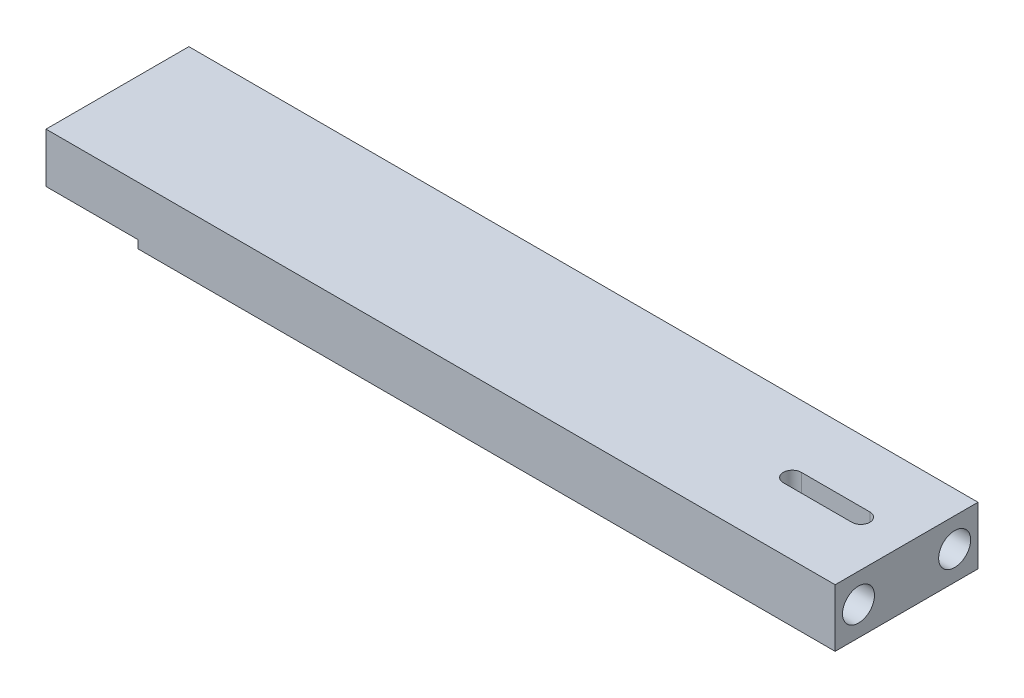
ISO-10303-21;
HEADER;
FILE_DESCRIPTION(('STEP AP214'),'2;1');
FILE_NAME('part.step','',(''),(''),'','','');
FILE_SCHEMA(('AUTOMOTIVE_DESIGN { 1 0 10303 214 1 1 1 1 }'));
ENDSEC;
DATA;
#1=APPLICATION_CONTEXT('core data for automotive mechanical design processes');
#2=APPLICATION_PROTOCOL_DEFINITION('international standard','automotive_design',2000,#1);
#3=PRODUCT_CONTEXT('',#1,'mechanical');
#4=PRODUCT('Part','Part','',(#3));
#5=PRODUCT_RELATED_PRODUCT_CATEGORY('part','',(#4));
#6=PRODUCT_DEFINITION_FORMATION('','',#4);
#7=PRODUCT_DEFINITION_CONTEXT('part definition',#1,'design');
#8=PRODUCT_DEFINITION('design','',#6,#7);
#9=PRODUCT_DEFINITION_SHAPE('','',#8);
#10=(LENGTH_UNIT() NAMED_UNIT(*) SI_UNIT(.MILLI.,.METRE.));
#11=(NAMED_UNIT(*) PLANE_ANGLE_UNIT() SI_UNIT($,.RADIAN.));
#12=(NAMED_UNIT(*) SI_UNIT($,.STERADIAN.) SOLID_ANGLE_UNIT());
#13=UNCERTAINTY_MEASURE_WITH_UNIT(LENGTH_MEASURE(1.E-05),#10,'distance_accuracy_value','');
#14=(GEOMETRIC_REPRESENTATION_CONTEXT(3) GLOBAL_UNCERTAINTY_ASSIGNED_CONTEXT((#13)) GLOBAL_UNIT_ASSIGNED_CONTEXT((#10,
#11,#12)) REPRESENTATION_CONTEXT('',''));
#15=CARTESIAN_POINT('',(0.,0.,0.));
#16=DIRECTION('',(0.,0.,1.));
#17=DIRECTION('',(1.,0.,0.));
#18=AXIS2_PLACEMENT_3D('',#15,#16,#17);
#19=CARTESIAN_POINT('',(49.75,0.,0.));
#20=DIRECTION('',(0.,1.,0.));
#21=DIRECTION('',(0.,0.,1.));
#22=AXIS2_PLACEMENT_3D('',#19,#20,#21);
#23=CYLINDRICAL_SURFACE('',#22,1.575);
#24=CARTESIAN_POINT('',(49.75,5.5,0.));
#25=DIRECTION('',(0.,-1.,0.));
#26=DIRECTION('',(0.,0.,-1.));
#27=AXIS2_PLACEMENT_3D('',#24,#25,#26);
#28=CIRCLE('',#27,1.575);
#29=CARTESIAN_POINT('',(49.75,5.5,-1.575));
#30=VERTEX_POINT('',#29);
#31=CARTESIAN_POINT('',(49.75,5.5,1.575));
#32=VERTEX_POINT('',#31);
#33=EDGE_CURVE('E56',#30,#32,#28,.F.);
#34=ORIENTED_EDGE('',*,*,#33,.F.);
#35=DIRECTION('',(0.,1.,0.));
#36=VECTOR('',#35,1.);
#37=CARTESIAN_POINT('',(49.75,0.,-1.575));
#38=LINE('',#37,#36);
#39=CARTESIAN_POINT('',(49.75,10.1,-1.575));
#40=VERTEX_POINT('',#39);
#41=EDGE_CURVE('E194',#30,#40,#38,.T.);
#42=ORIENTED_EDGE('',*,*,#41,.T.);
#43=CARTESIAN_POINT('',(49.75,10.1,0.));
#44=DIRECTION('',(0.,1.,0.));
#45=DIRECTION('',(0.,0.,1.));
#46=AXIS2_PLACEMENT_3D('',#43,#44,#45);
#47=CIRCLE('',#46,1.575);
#48=CARTESIAN_POINT('',(49.75,10.1,1.575));
#49=VERTEX_POINT('',#48);
#50=EDGE_CURVE('E181',#40,#49,#47,.T.);
#51=ORIENTED_EDGE('',*,*,#50,.T.);
#52=DIRECTION('',(0.,1.,0.));
#53=VECTOR('',#52,1.);
#54=CARTESIAN_POINT('',(49.75,0.,1.575));
#55=LINE('',#54,#53);
#56=EDGE_CURVE('E193',#32,#49,#55,.T.);
#57=ORIENTED_EDGE('',*,*,#56,.F.);
#58=EDGE_LOOP('',(#34,#42,#51,#57));
#59=FACE_BOUND('',#58,.T.);
#60=ADVANCED_FACE('F34',(#59),#23,.F.);
#61=CARTESIAN_POINT('',(49.75,0.,-1.575));
#62=DIRECTION('',(0.,0.,-1.));
#63=DIRECTION('',(-1.,0.,0.));
#64=AXIS2_PLACEMENT_3D('',#61,#62,#63);
#65=PLANE('',#64);
#66=DIRECTION('',(-1.,0.,0.));
#67=VECTOR('',#66,1.);
#68=CARTESIAN_POINT('',(49.75,5.5,-1.575));
#69=LINE('',#68,#67);
#70=CARTESIAN_POINT('',(61.75,5.5,-1.575));
#71=VERTEX_POINT('',#70);
#72=EDGE_CURVE('E178',#71,#30,#69,.T.);
#73=ORIENTED_EDGE('',*,*,#72,.F.);
#74=DIRECTION('',(0.,1.,0.));
#75=VECTOR('',#74,1.);
#76=CARTESIAN_POINT('',(61.75,0.,-1.575));
#77=LINE('',#76,#75);
#78=CARTESIAN_POINT('',(61.75,10.1,-1.575));
#79=VERTEX_POINT('',#78);
#80=EDGE_CURVE('E197',#71,#79,#77,.T.);
#81=ORIENTED_EDGE('',*,*,#80,.T.);
#82=DIRECTION('',(-1.,0.,0.));
#83=VECTOR('',#82,1.);
#84=CARTESIAN_POINT('',(49.75,10.1,-1.575));
#85=LINE('',#84,#83);
#86=EDGE_CURVE('E190',#79,#40,#85,.T.);
#87=ORIENTED_EDGE('',*,*,#86,.T.);
#88=ORIENTED_EDGE('',*,*,#41,.F.);
#89=EDGE_LOOP('',(#73,#81,#87,#88));
#90=FACE_BOUND('',#89,.T.);
#91=ADVANCED_FACE('F299',(#90),#65,.F.);
#92=CARTESIAN_POINT('',(61.75,0.,0.));
#93=DIRECTION('',(0.,1.,0.));
#94=DIRECTION('',(0.,0.,1.));
#95=AXIS2_PLACEMENT_3D('',#92,#93,#94);
#96=CYLINDRICAL_SURFACE('',#95,1.575);
#97=CARTESIAN_POINT('',(61.75,5.5,0.));
#98=DIRECTION('',(0.,-1.,0.));
#99=DIRECTION('',(0.,0.,-1.));
#100=AXIS2_PLACEMENT_3D('',#97,#98,#99);
#101=CIRCLE('',#100,1.575);
#102=CARTESIAN_POINT('',(61.75,5.5,1.575));
#103=VERTEX_POINT('',#102);
#104=EDGE_CURVE('E173',#103,#71,#101,.F.);
#105=ORIENTED_EDGE('',*,*,#104,.F.);
#106=DIRECTION('',(0.,1.,0.));
#107=VECTOR('',#106,1.);
#108=CARTESIAN_POINT('',(61.75,0.,1.575));
#109=LINE('',#108,#107);
#110=CARTESIAN_POINT('',(61.75,10.1,1.575));
#111=VERTEX_POINT('',#110);
#112=EDGE_CURVE('E199',#103,#111,#109,.T.);
#113=ORIENTED_EDGE('',*,*,#112,.T.);
#114=CARTESIAN_POINT('',(61.75,10.1,0.));
#115=DIRECTION('',(0.,1.,0.));
#116=DIRECTION('',(0.,0.,1.));
#117=AXIS2_PLACEMENT_3D('',#114,#115,#116);
#118=CIRCLE('',#117,1.575);
#119=EDGE_CURVE('E187',#111,#79,#118,.T.);
#120=ORIENTED_EDGE('',*,*,#119,.T.);
#121=ORIENTED_EDGE('',*,*,#80,.F.);
#122=EDGE_LOOP('',(#105,#113,#120,#121));
#123=FACE_BOUND('',#122,.T.);
#124=ADVANCED_FACE('F305',(#123),#96,.F.);
#125=CARTESIAN_POINT('',(49.75,0.,1.575));
#126=DIRECTION('',(0.,0.,1.));
#127=DIRECTION('',(1.,0.,0.));
#128=AXIS2_PLACEMENT_3D('',#125,#126,#127);
#129=PLANE('',#128);
#130=DIRECTION('',(1.,0.,0.));
#131=VECTOR('',#130,1.);
#132=CARTESIAN_POINT('',(49.75,5.5,1.575));
#133=LINE('',#132,#131);
#134=EDGE_CURVE('E11',#32,#103,#133,.T.);
#135=ORIENTED_EDGE('',*,*,#134,.F.);
#136=ORIENTED_EDGE('',*,*,#56,.T.);
#137=DIRECTION('',(1.,0.,0.));
#138=VECTOR('',#137,1.);
#139=CARTESIAN_POINT('',(49.75,10.1,1.575));
#140=LINE('',#139,#138);
#141=EDGE_CURVE('E184',#49,#111,#140,.T.);
#142=ORIENTED_EDGE('',*,*,#141,.T.);
#143=ORIENTED_EDGE('',*,*,#112,.F.);
#144=EDGE_LOOP('',(#135,#136,#142,#143));
#145=FACE_BOUND('',#144,.T.);
#146=ADVANCED_FACE('F310',(#145),#129,.F.);
#147=CARTESIAN_POINT('',(69.75,10.1,12.5));
#148=DIRECTION('',(-1.,0.,0.));
#149=DIRECTION('',(0.,0.,1.));
#150=AXIS2_PLACEMENT_3D('',#147,#148,#149);
#151=PLANE('',#150);
#152=CARTESIAN_POINT('',(69.75,5.05,-8.4125));
#153=DIRECTION('',(1.,0.,0.));
#154=DIRECTION('',(0.,0.,-1.));
#155=AXIS2_PLACEMENT_3D('',#152,#153,#154);
#156=CIRCLE('',#155,2.8);
#157=CARTESIAN_POINT('',(69.75,5.05,-11.2125));
#158=VERTEX_POINT('',#157);
#159=EDGE_CURVE('E352',#158,#158,#156,.T.);
#160=ORIENTED_EDGE('',*,*,#159,.F.);
#161=EDGE_LOOP('',(#160));
#162=FACE_BOUND('',#161,.T.);
#163=CARTESIAN_POINT('',(69.75,5.05,8.4125));
#164=DIRECTION('',(1.,0.,0.));
#165=DIRECTION('',(0.,0.,-1.));
#166=AXIS2_PLACEMENT_3D('',#163,#164,#165);
#167=CIRCLE('',#166,2.8);
#168=CARTESIAN_POINT('',(69.75,5.05,5.6125));
#169=VERTEX_POINT('',#168);
#170=EDGE_CURVE('E160',#169,#169,#167,.T.);
#171=ORIENTED_EDGE('',*,*,#170,.F.);
#172=EDGE_LOOP('',(#171));
#173=FACE_BOUND('',#172,.T.);
#174=DIRECTION('',(0.,0.,-1.));
#175=VECTOR('',#174,1.);
#176=CARTESIAN_POINT('',(69.75,0.,12.5));
#177=LINE('',#176,#175);
#178=CARTESIAN_POINT('',(69.75,0.,12.5));
#179=VERTEX_POINT('',#178);
#180=CARTESIAN_POINT('',(69.75,0.,-12.5));
#181=VERTEX_POINT('',#180);
#182=EDGE_CURVE('E234',#179,#181,#177,.T.);
#183=ORIENTED_EDGE('',*,*,#182,.T.);
#184=DIRECTION('',(0.,-1.,0.));
#185=VECTOR('',#184,1.);
#186=CARTESIAN_POINT('',(69.75,10.1,-12.5));
#187=LINE('',#186,#185);
#188=CARTESIAN_POINT('',(69.75,10.1,-12.5));
#189=VERTEX_POINT('',#188);
#190=EDGE_CURVE('E42',#189,#181,#187,.T.);
#191=ORIENTED_EDGE('',*,*,#190,.F.);
#192=DIRECTION('',(0.,0.,-1.));
#193=VECTOR('',#192,1.);
#194=CARTESIAN_POINT('',(69.75,10.1,12.5));
#195=LINE('',#194,#193);
#196=CARTESIAN_POINT('',(69.75,10.1,12.5));
#197=VERTEX_POINT('',#196);
#198=EDGE_CURVE('E240',#197,#189,#195,.T.);
#199=ORIENTED_EDGE('',*,*,#198,.F.);
#200=DIRECTION('',(0.,-1.,0.));
#201=VECTOR('',#200,1.);
#202=CARTESIAN_POINT('',(69.75,10.1,12.5));
#203=LINE('',#202,#201);
#204=EDGE_CURVE('E249',#197,#179,#203,.T.);
#205=ORIENTED_EDGE('',*,*,#204,.T.);
#206=EDGE_LOOP('',(#183,#191,#199,#205));
#207=FACE_BOUND('',#206,.T.);
#208=ADVANCED_FACE('F36',(#162,#173,#207),#151,.F.);
#209=CARTESIAN_POINT('',(-69.75,10.1,-12.5));
#210=DIRECTION('',(0.,0.,1.));
#211=DIRECTION('',(1.,0.,0.));
#212=AXIS2_PLACEMENT_3D('',#209,#210,#211);
#213=PLANE('',#212);
#214=DIRECTION('',(-1.,0.,0.));
#215=VECTOR('',#214,1.);
#216=CARTESIAN_POINT('',(-52.25,1.4,-12.5));
#217=LINE('',#216,#215);
#218=CARTESIAN_POINT('',(-52.25,1.4,-12.5));
#219=VERTEX_POINT('',#218);
#220=CARTESIAN_POINT('',(-68.35,1.4,-12.5));
#221=VERTEX_POINT('',#220);
#222=EDGE_CURVE('E217',#219,#221,#217,.T.);
#223=ORIENTED_EDGE('',*,*,#222,.T.);
#224=DIRECTION('',(0.,1.,0.));
#225=VECTOR('',#224,1.);
#226=CARTESIAN_POINT('',(-68.35,1.4,-12.5));
#227=LINE('',#226,#225);
#228=CARTESIAN_POINT('',(-68.35,10.1,-12.5));
#229=VERTEX_POINT('',#228);
#230=EDGE_CURVE('E221',#221,#229,#227,.T.);
#231=ORIENTED_EDGE('',*,*,#230,.T.);
#232=DIRECTION('',(-1.,0.,0.));
#233=VECTOR('',#232,1.);
#234=CARTESIAN_POINT('',(-69.75,10.1,-12.5));
#235=LINE('',#234,#233);
#236=EDGE_CURVE('E243',#189,#229,#235,.T.);
#237=ORIENTED_EDGE('',*,*,#236,.F.);
#238=ORIENTED_EDGE('',*,*,#190,.T.);
#239=DIRECTION('',(-1.,0.,0.));
#240=VECTOR('',#239,1.);
#241=CARTESIAN_POINT('',(-69.75,0.,-12.5));
#242=LINE('',#241,#240);
#243=CARTESIAN_POINT('',(-52.25,0.,-12.5));
#244=VERTEX_POINT('',#243);
#245=EDGE_CURVE('E252',#181,#244,#242,.T.);
#246=ORIENTED_EDGE('',*,*,#245,.T.);
#247=DIRECTION('',(0.,1.,0.));
#248=VECTOR('',#247,1.);
#249=CARTESIAN_POINT('',(-52.25,0.,-12.5));
#250=LINE('',#249,#248);
#251=EDGE_CURVE('E214',#244,#219,#250,.T.);
#252=ORIENTED_EDGE('',*,*,#251,.T.);
#253=EDGE_LOOP('',(#223,#231,#237,#238,#246,#252));
#254=FACE_BOUND('',#253,.T.);
#255=ADVANCED_FACE('F260',(#254),#213,.F.);
#256=CARTESIAN_POINT('',(-69.75,10.1,12.5));
#257=DIRECTION('',(0.,0.,-1.));
#258=DIRECTION('',(-1.,0.,0.));
#259=AXIS2_PLACEMENT_3D('',#256,#257,#258);
#260=PLANE('',#259);
#261=DIRECTION('',(1.,0.,0.));
#262=VECTOR('',#261,1.);
#263=CARTESIAN_POINT('',(-69.75,10.1,12.5));
#264=LINE('',#263,#262);
#265=CARTESIAN_POINT('',(-68.35,10.1,12.5));
#266=VERTEX_POINT('',#265);
#267=EDGE_CURVE('E247',#266,#197,#264,.T.);
#268=ORIENTED_EDGE('',*,*,#267,.F.);
#269=DIRECTION('',(0.,1.,0.));
#270=VECTOR('',#269,1.);
#271=CARTESIAN_POINT('',(-68.35,1.4,12.5));
#272=LINE('',#271,#270);
#273=CARTESIAN_POINT('',(-68.35,1.4,12.5));
#274=VERTEX_POINT('',#273);
#275=EDGE_CURVE('E218',#274,#266,#272,.T.);
#276=ORIENTED_EDGE('',*,*,#275,.F.);
#277=DIRECTION('',(-1.,0.,0.));
#278=VECTOR('',#277,1.);
#279=CARTESIAN_POINT('',(-52.25,1.4,12.5));
#280=LINE('',#279,#278);
#281=CARTESIAN_POINT('',(-52.25,1.4,12.5));
#282=VERTEX_POINT('',#281);
#283=EDGE_CURVE('E227',#282,#274,#280,.T.);
#284=ORIENTED_EDGE('',*,*,#283,.F.);
#285=DIRECTION('',(0.,1.,0.));
#286=VECTOR('',#285,1.);
#287=CARTESIAN_POINT('',(-52.25,0.,12.5));
#288=LINE('',#287,#286);
#289=CARTESIAN_POINT('',(-52.25,0.,12.5));
#290=VERTEX_POINT('',#289);
#291=EDGE_CURVE('E211',#290,#282,#288,.T.);
#292=ORIENTED_EDGE('',*,*,#291,.F.);
#293=DIRECTION('',(1.,0.,0.));
#294=VECTOR('',#293,1.);
#295=CARTESIAN_POINT('',(-69.75,0.,12.5));
#296=LINE('',#295,#294);
#297=EDGE_CURVE('E244',#290,#179,#296,.T.);
#298=ORIENTED_EDGE('',*,*,#297,.T.);
#299=ORIENTED_EDGE('',*,*,#204,.F.);
#300=EDGE_LOOP('',(#268,#276,#284,#292,#298,#299));
#301=FACE_BOUND('',#300,.T.);
#302=ADVANCED_FACE('F275',(#301),#260,.F.);
#303=CARTESIAN_POINT('',(0.,10.1,0.));
#304=DIRECTION('',(0.,-1.,0.));
#305=DIRECTION('',(0.,0.,-1.));
#306=AXIS2_PLACEMENT_3D('',#303,#304,#305);
#307=PLANE('',#306);
#308=ORIENTED_EDGE('',*,*,#141,.F.);
#309=ORIENTED_EDGE('',*,*,#50,.F.);
#310=ORIENTED_EDGE('',*,*,#86,.F.);
#311=ORIENTED_EDGE('',*,*,#119,.F.);
#312=EDGE_LOOP('',(#308,#309,#310,#311));
#313=FACE_BOUND('',#312,.T.);
#314=ORIENTED_EDGE('',*,*,#236,.T.);
#315=DIRECTION('',(0.,0.,1.));
#316=VECTOR('',#315,1.);
#317=CARTESIAN_POINT('',(-68.35,10.1,-12.5));
#318=LINE('',#317,#316);
#319=EDGE_CURVE('E231',#229,#266,#318,.T.);
#320=ORIENTED_EDGE('',*,*,#319,.T.);
#321=ORIENTED_EDGE('',*,*,#267,.T.);
#322=ORIENTED_EDGE('',*,*,#198,.T.);
#323=EDGE_LOOP('',(#314,#320,#321,#322));
#324=FACE_BOUND('',#323,.T.);
#325=ADVANCED_FACE('F283',(#313,#324),#307,.F.);
#326=CARTESIAN_POINT('',(0.,0.,0.));
#327=DIRECTION('',(0.,-1.,0.));
#328=DIRECTION('',(0.,0.,-1.));
#329=AXIS2_PLACEMENT_3D('',#326,#327,#328);
#330=PLANE('',#329);
#331=CARTESIAN_POINT('',(49.75,0.,0.));
#332=DIRECTION('',(0.,-1.,0.));
#333=DIRECTION('',(0.,0.,-1.));
#334=AXIS2_PLACEMENT_3D('',#331,#332,#333);
#335=CIRCLE('',#334,4.325);
#336=CARTESIAN_POINT('',(49.75,0.,4.325));
#337=VERTEX_POINT('',#336);
#338=CARTESIAN_POINT('',(49.75,0.,-4.325));
#339=VERTEX_POINT('',#338);
#340=EDGE_CURVE('E49',#337,#339,#335,.T.);
#341=ORIENTED_EDGE('',*,*,#340,.F.);
#342=DIRECTION('',(-1.,0.,0.));
#343=VECTOR('',#342,1.);
#344=CARTESIAN_POINT('',(49.75,0.,4.325));
#345=LINE('',#344,#343);
#346=CARTESIAN_POINT('',(61.75,0.,4.325));
#347=VERTEX_POINT('',#346);
#348=EDGE_CURVE('E154',#347,#337,#345,.T.);
#349=ORIENTED_EDGE('',*,*,#348,.F.);
#350=CARTESIAN_POINT('',(61.75,0.,0.));
#351=DIRECTION('',(0.,-1.,0.));
#352=DIRECTION('',(0.,0.,-1.));
#353=AXIS2_PLACEMENT_3D('',#350,#351,#352);
#354=CIRCLE('',#353,4.325);
#355=CARTESIAN_POINT('',(61.75,0.,-4.325));
#356=VERTEX_POINT('',#355);
#357=EDGE_CURVE('E157',#356,#347,#354,.T.);
#358=ORIENTED_EDGE('',*,*,#357,.F.);
#359=DIRECTION('',(1.,0.,0.));
#360=VECTOR('',#359,1.);
#361=CARTESIAN_POINT('',(61.75,0.,-4.325));
#362=LINE('',#361,#360);
#363=EDGE_CURVE('E166',#339,#356,#362,.T.);
#364=ORIENTED_EDGE('',*,*,#363,.F.);
#365=EDGE_LOOP('',(#341,#349,#358,#364));
#366=FACE_BOUND('',#365,.T.);
#367=DIRECTION('',(0.,0.,1.));
#368=VECTOR('',#367,1.);
#369=CARTESIAN_POINT('',(-52.25,0.,-12.5));
#370=LINE('',#369,#368);
#371=EDGE_CURVE('E224',#244,#290,#370,.T.);
#372=ORIENTED_EDGE('',*,*,#371,.F.);
#373=ORIENTED_EDGE('',*,*,#245,.F.);
#374=ORIENTED_EDGE('',*,*,#182,.F.);
#375=ORIENTED_EDGE('',*,*,#297,.F.);
#376=EDGE_LOOP('',(#372,#373,#374,#375));
#377=FACE_BOUND('',#376,.T.);
#378=ADVANCED_FACE('F268',(#366,#377),#330,.T.);
#379=CARTESIAN_POINT('',(-68.35,1.4,-12.5));
#380=DIRECTION('',(1.,0.,0.));
#381=DIRECTION('',(0.,0.,-1.));
#382=AXIS2_PLACEMENT_3D('',#379,#380,#381);
#383=PLANE('',#382);
#384=CARTESIAN_POINT('',(-68.35,5.75,7.5));
#385=DIRECTION('',(-1.,0.,0.));
#386=DIRECTION('',(0.,0.,1.));
#387=AXIS2_PLACEMENT_3D('',#384,#385,#386);
#388=CIRCLE('',#387,2.675);
#389=CARTESIAN_POINT('',(-68.35,5.75,10.175));
#390=VERTEX_POINT('',#389);
#391=EDGE_CURVE('E196',#390,#390,#388,.T.);
#392=ORIENTED_EDGE('',*,*,#391,.F.);
#393=EDGE_LOOP('',(#392));
#394=FACE_BOUND('',#393,.T.);
#395=CARTESIAN_POINT('',(-68.35,5.75,-7.5));
#396=DIRECTION('',(-1.,0.,0.));
#397=DIRECTION('',(0.,0.,1.));
#398=AXIS2_PLACEMENT_3D('',#395,#396,#397);
#399=CIRCLE('',#398,2.675);
#400=CARTESIAN_POINT('',(-68.35,5.75,-4.825));
#401=VERTEX_POINT('',#400);
#402=EDGE_CURVE('E205',#401,#401,#399,.T.);
#403=ORIENTED_EDGE('',*,*,#402,.F.);
#404=EDGE_LOOP('',(#403));
#405=FACE_BOUND('',#404,.T.);
#406=ORIENTED_EDGE('',*,*,#275,.T.);
#407=ORIENTED_EDGE('',*,*,#319,.F.);
#408=ORIENTED_EDGE('',*,*,#230,.F.);
#409=DIRECTION('',(0.,0.,1.));
#410=VECTOR('',#409,1.);
#411=CARTESIAN_POINT('',(-68.35,1.4,-12.5));
#412=LINE('',#411,#410);
#413=EDGE_CURVE('E235',#221,#274,#412,.T.);
#414=ORIENTED_EDGE('',*,*,#413,.T.);
#415=EDGE_LOOP('',(#406,#407,#408,#414));
#416=FACE_BOUND('',#415,.T.);
#417=ADVANCED_FACE('F284',(#394,#405,#416),#383,.F.);
#418=CARTESIAN_POINT('',(-52.25,1.4,-12.5));
#419=DIRECTION('',(0.,1.,0.));
#420=DIRECTION('',(-1.,0.,0.));
#421=AXIS2_PLACEMENT_3D('',#418,#419,#420);
#422=PLANE('',#421);
#423=ORIENTED_EDGE('',*,*,#283,.T.);
#424=ORIENTED_EDGE('',*,*,#413,.F.);
#425=ORIENTED_EDGE('',*,*,#222,.F.);
#426=DIRECTION('',(0.,0.,1.));
#427=VECTOR('',#426,1.);
#428=CARTESIAN_POINT('',(-52.25,1.4,-12.5));
#429=LINE('',#428,#427);
#430=EDGE_CURVE('E237',#219,#282,#429,.T.);
#431=ORIENTED_EDGE('',*,*,#430,.T.);
#432=EDGE_LOOP('',(#423,#424,#425,#431));
#433=FACE_BOUND('',#432,.T.);
#434=ADVANCED_FACE('F278',(#433),#422,.F.);
#435=CARTESIAN_POINT('',(-52.25,0.,-12.5));
#436=DIRECTION('',(1.,0.,0.));
#437=DIRECTION('',(0.,0.,-1.));
#438=AXIS2_PLACEMENT_3D('',#435,#436,#437);
#439=PLANE('',#438);
#440=ORIENTED_EDGE('',*,*,#291,.T.);
#441=ORIENTED_EDGE('',*,*,#430,.F.);
#442=ORIENTED_EDGE('',*,*,#251,.F.);
#443=ORIENTED_EDGE('',*,*,#371,.T.);
#444=EDGE_LOOP('',(#440,#441,#442,#443));
#445=FACE_BOUND('',#444,.T.);
#446=ADVANCED_FACE('F271',(#445),#439,.F.);
#447=CARTESIAN_POINT('',(-53.35,5.75,-7.5));
#448=DIRECTION('',(-1.,0.,0.));
#449=DIRECTION('',(0.,0.,1.));
#450=AXIS2_PLACEMENT_3D('',#447,#448,#449);
#451=CYLINDRICAL_SURFACE('',#450,2.675);
#452=CARTESIAN_POINT('',(-53.35,5.75,-7.5));
#453=DIRECTION('',(-1.,0.,0.));
#454=DIRECTION('',(0.,0.,1.));
#455=AXIS2_PLACEMENT_3D('',#452,#453,#454);
#456=CIRCLE('',#455,2.675);
#457=CARTESIAN_POINT('',(-53.35,5.75,-4.825));
#458=VERTEX_POINT('',#457);
#459=EDGE_CURVE('E208',#458,#458,#456,.T.);
#460=ORIENTED_EDGE('',*,*,#459,.F.);
#461=EDGE_LOOP('',(#460));
#462=FACE_BOUND('',#461,.T.);
#463=ORIENTED_EDGE('',*,*,#402,.T.);
#464=EDGE_LOOP('',(#463));
#465=FACE_BOUND('',#464,.T.);
#466=ADVANCED_FACE('F322',(#462,#465),#451,.F.);
#467=CARTESIAN_POINT('',(-53.35,5.75,-7.5));
#468=DIRECTION('',(-1.,0.,0.));
#469=DIRECTION('',(0.,0.,1.));
#470=AXIS2_PLACEMENT_3D('',#467,#468,#469);
#471=PLANE('',#470);
#472=ORIENTED_EDGE('',*,*,#459,.T.);
#473=EDGE_LOOP('',(#472));
#474=FACE_BOUND('',#473,.T.);
#475=ADVANCED_FACE('F319',(#474),#471,.T.);
#476=CARTESIAN_POINT('',(-53.35,5.75,7.5));
#477=DIRECTION('',(-1.,0.,0.));
#478=DIRECTION('',(0.,0.,1.));
#479=AXIS2_PLACEMENT_3D('',#476,#477,#478);
#480=CYLINDRICAL_SURFACE('',#479,2.675);
#481=CARTESIAN_POINT('',(-53.35,5.75,7.5));
#482=DIRECTION('',(-1.,0.,0.));
#483=DIRECTION('',(0.,0.,1.));
#484=AXIS2_PLACEMENT_3D('',#481,#482,#483);
#485=CIRCLE('',#484,2.675);
#486=CARTESIAN_POINT('',(-53.35,5.75,10.175));
#487=VERTEX_POINT('',#486);
#488=EDGE_CURVE('E202',#487,#487,#485,.T.);
#489=ORIENTED_EDGE('',*,*,#488,.F.);
#490=EDGE_LOOP('',(#489));
#491=FACE_BOUND('',#490,.T.);
#492=ORIENTED_EDGE('',*,*,#391,.T.);
#493=EDGE_LOOP('',(#492));
#494=FACE_BOUND('',#493,.T.);
#495=ADVANCED_FACE('F315',(#491,#494),#480,.F.);
#496=CARTESIAN_POINT('',(-53.35,5.75,7.5));
#497=DIRECTION('',(-1.,0.,0.));
#498=DIRECTION('',(0.,0.,1.));
#499=AXIS2_PLACEMENT_3D('',#496,#497,#498);
#500=PLANE('',#499);
#501=ORIENTED_EDGE('',*,*,#488,.T.);
#502=EDGE_LOOP('',(#501));
#503=FACE_BOUND('',#502,.T.);
#504=ADVANCED_FACE('F312',(#503),#500,.T.);
#505=CARTESIAN_POINT('',(49.75,5.5,0.));
#506=DIRECTION('',(0.,-1.,0.));
#507=DIRECTION('',(0.,0.,-1.));
#508=AXIS2_PLACEMENT_3D('',#505,#506,#507);
#509=PLANE('',#508);
#510=CARTESIAN_POINT('',(49.75,5.5,0.));
#511=DIRECTION('',(0.,-1.,0.));
#512=DIRECTION('',(0.,0.,-1.));
#513=AXIS2_PLACEMENT_3D('',#510,#511,#512);
#514=CIRCLE('',#513,4.325);
#515=CARTESIAN_POINT('',(49.75,5.5,4.325));
#516=VERTEX_POINT('',#515);
#517=CARTESIAN_POINT('',(49.75,5.5,-4.325));
#518=VERTEX_POINT('',#517);
#519=EDGE_CURVE('E136',#516,#518,#514,.T.);
#520=ORIENTED_EDGE('',*,*,#519,.T.);
#521=DIRECTION('',(1.,0.,0.));
#522=VECTOR('',#521,1.);
#523=CARTESIAN_POINT('',(61.75,5.5,-4.325));
#524=LINE('',#523,#522);
#525=CARTESIAN_POINT('',(61.75,5.5,-4.325));
#526=VERTEX_POINT('',#525);
#527=EDGE_CURVE('E145',#518,#526,#524,.T.);
#528=ORIENTED_EDGE('',*,*,#527,.T.);
#529=CARTESIAN_POINT('',(61.75,5.5,0.));
#530=DIRECTION('',(0.,-1.,0.));
#531=DIRECTION('',(0.,0.,-1.));
#532=AXIS2_PLACEMENT_3D('',#529,#530,#531);
#533=CIRCLE('',#532,4.325);
#534=CARTESIAN_POINT('',(61.75,5.5,4.325));
#535=VERTEX_POINT('',#534);
#536=EDGE_CURVE('E150',#526,#535,#533,.T.);
#537=ORIENTED_EDGE('',*,*,#536,.T.);
#538=DIRECTION('',(-1.,0.,0.));
#539=VECTOR('',#538,1.);
#540=CARTESIAN_POINT('',(49.75,5.5,4.325));
#541=LINE('',#540,#539);
#542=EDGE_CURVE('E142',#535,#516,#541,.T.);
#543=ORIENTED_EDGE('',*,*,#542,.T.);
#544=EDGE_LOOP('',(#520,#528,#537,#543));
#545=FACE_BOUND('',#544,.T.);
#546=ORIENTED_EDGE('',*,*,#33,.T.);
#547=ORIENTED_EDGE('',*,*,#134,.T.);
#548=ORIENTED_EDGE('',*,*,#104,.T.);
#549=ORIENTED_EDGE('',*,*,#72,.T.);
#550=EDGE_LOOP('',(#546,#547,#548,#549));
#551=FACE_BOUND('',#550,.T.);
#552=ADVANCED_FACE('F152',(#545,#551),#509,.T.);
#553=CARTESIAN_POINT('',(49.75,5.5,0.));
#554=DIRECTION('',(0.,-1.,0.));
#555=DIRECTION('',(0.,0.,-1.));
#556=AXIS2_PLACEMENT_3D('',#553,#554,#555);
#557=CYLINDRICAL_SURFACE('',#556,4.325);
#558=ORIENTED_EDGE('',*,*,#340,.T.);
#559=DIRECTION('',(0.,-1.,0.));
#560=VECTOR('',#559,1.);
#561=CARTESIAN_POINT('',(49.75,5.5,-4.325));
#562=LINE('',#561,#560);
#563=EDGE_CURVE('E132',#518,#339,#562,.T.);
#564=ORIENTED_EDGE('',*,*,#563,.F.);
#565=ORIENTED_EDGE('',*,*,#519,.F.);
#566=DIRECTION('',(0.,-1.,0.));
#567=VECTOR('',#566,1.);
#568=CARTESIAN_POINT('',(49.75,5.5,4.325));
#569=LINE('',#568,#567);
#570=EDGE_CURVE('E171',#516,#337,#569,.T.);
#571=ORIENTED_EDGE('',*,*,#570,.T.);
#572=EDGE_LOOP('',(#558,#564,#565,#571));
#573=FACE_BOUND('',#572,.T.);
#574=ADVANCED_FACE('F134',(#573),#557,.F.);
#575=CARTESIAN_POINT('',(49.75,5.5,4.325));
#576=DIRECTION('',(0.,0.,1.));
#577=DIRECTION('',(1.,0.,0.));
#578=AXIS2_PLACEMENT_3D('',#575,#576,#577);
#579=PLANE('',#578);
#580=ORIENTED_EDGE('',*,*,#348,.T.);
#581=ORIENTED_EDGE('',*,*,#570,.F.);
#582=ORIENTED_EDGE('',*,*,#542,.F.);
#583=DIRECTION('',(0.,-1.,0.));
#584=VECTOR('',#583,1.);
#585=CARTESIAN_POINT('',(61.75,5.5,4.325));
#586=LINE('',#585,#584);
#587=EDGE_CURVE('E174',#535,#347,#586,.T.);
#588=ORIENTED_EDGE('',*,*,#587,.T.);
#589=EDGE_LOOP('',(#580,#581,#582,#588));
#590=FACE_BOUND('',#589,.T.);
#591=ADVANCED_FACE('F384',(#590),#579,.F.);
#592=CARTESIAN_POINT('',(61.75,5.5,0.));
#593=DIRECTION('',(0.,-1.,0.));
#594=DIRECTION('',(0.,0.,-1.));
#595=AXIS2_PLACEMENT_3D('',#592,#593,#594);
#596=CYLINDRICAL_SURFACE('',#595,4.325);
#597=ORIENTED_EDGE('',*,*,#357,.T.);
#598=ORIENTED_EDGE('',*,*,#587,.F.);
#599=ORIENTED_EDGE('',*,*,#536,.F.);
#600=DIRECTION('',(0.,-1.,0.));
#601=VECTOR('',#600,1.);
#602=CARTESIAN_POINT('',(61.75,5.5,-4.325));
#603=LINE('',#602,#601);
#604=EDGE_CURVE('E141',#526,#356,#603,.T.);
#605=ORIENTED_EDGE('',*,*,#604,.T.);
#606=EDGE_LOOP('',(#597,#598,#599,#605));
#607=FACE_BOUND('',#606,.T.);
#608=ADVANCED_FACE('F387',(#607),#596,.F.);
#609=CARTESIAN_POINT('',(61.75,5.5,-4.325));
#610=DIRECTION('',(0.,0.,-1.));
#611=DIRECTION('',(-1.,0.,0.));
#612=AXIS2_PLACEMENT_3D('',#609,#610,#611);
#613=PLANE('',#612);
#614=ORIENTED_EDGE('',*,*,#363,.T.);
#615=ORIENTED_EDGE('',*,*,#604,.F.);
#616=ORIENTED_EDGE('',*,*,#527,.F.);
#617=ORIENTED_EDGE('',*,*,#563,.T.);
#618=EDGE_LOOP('',(#614,#615,#616,#617));
#619=FACE_BOUND('',#618,.T.);
#620=ADVANCED_FACE('F146',(#619),#613,.F.);
#621=CARTESIAN_POINT('',(54.75,5.05,8.4125));
#622=DIRECTION('',(1.,0.,0.));
#623=DIRECTION('',(0.,0.,-1.));
#624=AXIS2_PLACEMENT_3D('',#621,#622,#623);
#625=CYLINDRICAL_SURFACE('',#624,2.8);
#626=CARTESIAN_POINT('',(54.75,5.05,8.4125));
#627=DIRECTION('',(1.,0.,0.));
#628=DIRECTION('',(0.,0.,-1.));
#629=AXIS2_PLACEMENT_3D('',#626,#627,#628);
#630=CIRCLE('',#629,2.8);
#631=CARTESIAN_POINT('',(54.75,5.05,5.6125));
#632=VERTEX_POINT('',#631);
#633=EDGE_CURVE('E167',#632,#632,#630,.T.);
#634=ORIENTED_EDGE('',*,*,#633,.F.);
#635=EDGE_LOOP('',(#634));
#636=FACE_BOUND('',#635,.T.);
#637=ORIENTED_EDGE('',*,*,#170,.T.);
#638=EDGE_LOOP('',(#637));
#639=FACE_BOUND('',#638,.T.);
#640=ADVANCED_FACE('F375',(#636,#639),#625,.F.);
#641=CARTESIAN_POINT('',(54.75,5.05,8.4125));
#642=DIRECTION('',(1.,0.,0.));
#643=DIRECTION('',(0.,0.,-1.));
#644=AXIS2_PLACEMENT_3D('',#641,#642,#643);
#645=PLANE('',#644);
#646=ORIENTED_EDGE('',*,*,#633,.T.);
#647=EDGE_LOOP('',(#646));
#648=FACE_BOUND('',#647,.T.);
#649=ADVANCED_FACE('F367',(#648),#645,.T.);
#650=CARTESIAN_POINT('',(54.75,5.05,-8.4125));
#651=DIRECTION('',(1.,0.,0.));
#652=DIRECTION('',(0.,0.,-1.));
#653=AXIS2_PLACEMENT_3D('',#650,#651,#652);
#654=CYLINDRICAL_SURFACE('',#653,2.8);
#655=CARTESIAN_POINT('',(54.75,5.05,-8.4125));
#656=DIRECTION('',(1.,0.,0.));
#657=DIRECTION('',(0.,0.,-1.));
#658=AXIS2_PLACEMENT_3D('',#655,#656,#657);
#659=CIRCLE('',#658,2.8);
#660=CARTESIAN_POINT('',(54.75,5.05,-11.2125));
#661=VERTEX_POINT('',#660);
#662=EDGE_CURVE('E356',#661,#661,#659,.T.);
#663=ORIENTED_EDGE('',*,*,#662,.F.);
#664=EDGE_LOOP('',(#663));
#665=FACE_BOUND('',#664,.T.);
#666=ORIENTED_EDGE('',*,*,#159,.T.);
#667=EDGE_LOOP('',(#666));
#668=FACE_BOUND('',#667,.T.);
#669=ADVANCED_FACE('F364',(#665,#668),#654,.F.);
#670=CARTESIAN_POINT('',(54.75,5.05,-8.4125));
#671=DIRECTION('',(1.,0.,0.));
#672=DIRECTION('',(0.,0.,-1.));
#673=AXIS2_PLACEMENT_3D('',#670,#671,#672);
#674=PLANE('',#673);
#675=ORIENTED_EDGE('',*,*,#662,.T.);
#676=EDGE_LOOP('',(#675));
#677=FACE_BOUND('',#676,.T.);
#678=ADVANCED_FACE('F366',(#677),#674,.T.);
#679=CLOSED_SHELL('',(#60,#91,#124,#146,#208,#255,#302,#325,#378,#417,#434,#446,#466,#475,#495,
#504,#552,#574,#591,#608,#620,#640,#649,#669,#678));
#680=MANIFOLD_SOLID_BREP('B2',#679);
#681=ADVANCED_BREP_SHAPE_REPRESENTATION('',(#18,#680),#14);
#682=SHAPE_DEFINITION_REPRESENTATION(#9,#681);
ENDSEC;
END-ISO-10303-21;
